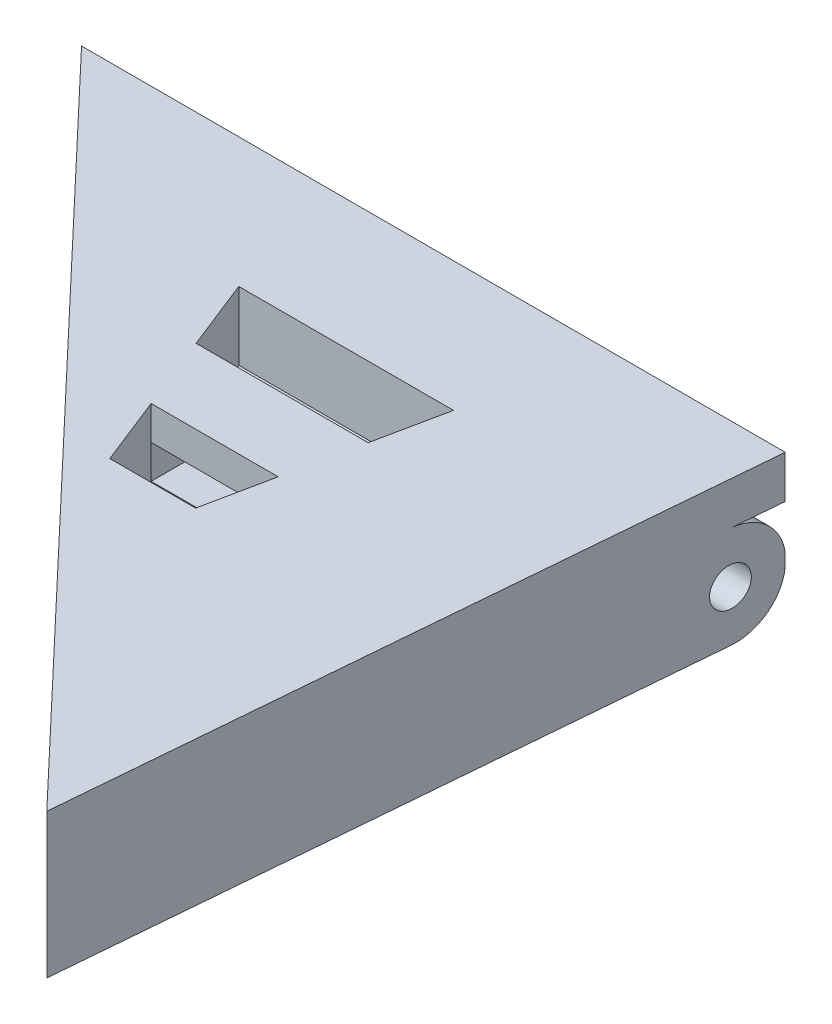
ISO-10303-21;
HEADER;
FILE_DESCRIPTION(('STEP AP214'),'2;1');
FILE_NAME('part.step','',(''),(''),'','','');
FILE_SCHEMA(('AUTOMOTIVE_DESIGN { 1 0 10303 214 1 1 1 1 }'));
ENDSEC;
DATA;
#1=APPLICATION_CONTEXT('core data for automotive mechanical design processes');
#2=APPLICATION_PROTOCOL_DEFINITION('international standard','automotive_design',2000,#1);
#3=PRODUCT_CONTEXT('',#1,'mechanical');
#4=PRODUCT('Part','Part','',(#3));
#5=PRODUCT_RELATED_PRODUCT_CATEGORY('part','',(#4));
#6=PRODUCT_DEFINITION_FORMATION('','',#4);
#7=PRODUCT_DEFINITION_CONTEXT('part definition',#1,'design');
#8=PRODUCT_DEFINITION('design','',#6,#7);
#9=PRODUCT_DEFINITION_SHAPE('','',#8);
#10=(LENGTH_UNIT() NAMED_UNIT(*) SI_UNIT(.MILLI.,.METRE.));
#11=(NAMED_UNIT(*) PLANE_ANGLE_UNIT() SI_UNIT($,.RADIAN.));
#12=(NAMED_UNIT(*) SI_UNIT($,.STERADIAN.) SOLID_ANGLE_UNIT());
#13=UNCERTAINTY_MEASURE_WITH_UNIT(LENGTH_MEASURE(1.E-05),#10,'distance_accuracy_value','');
#14=(GEOMETRIC_REPRESENTATION_CONTEXT(3) GLOBAL_UNCERTAINTY_ASSIGNED_CONTEXT((#13)) GLOBAL_UNIT_ASSIGNED_CONTEXT((#10,
#11,#12)) REPRESENTATION_CONTEXT('',''));
#15=CARTESIAN_POINT('',(0.,0.,0.));
#16=DIRECTION('',(0.,0.,1.));
#17=DIRECTION('',(1.,0.,0.));
#18=AXIS2_PLACEMENT_3D('',#15,#16,#17);
#19=CARTESIAN_POINT('',(0.,15.24,0.));
#20=DIRECTION('',(0.,0.,1.));
#21=DIRECTION('',(1.,0.,0.));
#22=AXIS2_PLACEMENT_3D('',#19,#20,#21);
#23=PLANE('',#22);
#24=DIRECTION('',(1.,0.,0.));
#25=VECTOR('',#24,1.);
#26=CARTESIAN_POINT('',(-7.2094547130586,12.7,0.));
#27=LINE('',#26,#25);
#28=CARTESIAN_POINT('',(0.,12.7,0.));
#29=VERTEX_POINT('',#28);
#30=CARTESIAN_POINT('',(21.1386477693797,12.7,0.));
#31=VERTEX_POINT('',#30);
#32=EDGE_CURVE('E275',#29,#31,#27,.T.);
#33=ORIENTED_EDGE('',*,*,#32,.T.);
#34=DIRECTION('',(0.,-1.,0.));
#35=VECTOR('',#34,1.);
#36=CARTESIAN_POINT('',(21.1386477693797,15.24,0.));
#37=LINE('',#36,#35);
#38=CARTESIAN_POINT('',(21.1386477693797,6.64498479126935,0.));
#39=VERTEX_POINT('',#38);
#40=EDGE_CURVE('E437',#31,#39,#37,.T.);
#41=ORIENTED_EDGE('',*,*,#40,.T.);
#42=DIRECTION('',(1.,0.,0.));
#43=VECTOR('',#42,1.);
#44=CARTESIAN_POINT('',(0.,6.64498479126935,0.));
#45=LINE('',#44,#43);
#46=CARTESIAN_POINT('',(0.,6.64498479126935,0.));
#47=VERTEX_POINT('',#46);
#48=EDGE_CURVE('E457',#47,#39,#45,.T.);
#49=ORIENTED_EDGE('',*,*,#48,.F.);
#50=DIRECTION('',(0.,-1.,0.));
#51=VECTOR('',#50,1.);
#52=CARTESIAN_POINT('',(0.,15.24,0.));
#53=LINE('',#52,#51);
#54=EDGE_CURVE('E434',#29,#47,#53,.T.);
#55=ORIENTED_EDGE('',*,*,#54,.F.);
#56=EDGE_LOOP('',(#33,#41,#49,#55));
#57=FACE_BOUND('',#56,.T.);
#58=ADVANCED_FACE('F94',(#57),#23,.F.);
#59=CARTESIAN_POINT('',(0.,11.176,10.3526951247771));
#60=DIRECTION('',(0.,0.,-1.));
#61=DIRECTION('',(-1.,0.,0.));
#62=AXIS2_PLACEMENT_3D('',#59,#60,#61);
#63=PLANE('',#62);
#64=DIRECTION('',(0.,1.,0.));
#65=VECTOR('',#64,1.);
#66=CARTESIAN_POINT('',(15.1568269692433,11.176,10.3526951247771));
#67=LINE('',#66,#65);
#68=CARTESIAN_POINT('',(15.1568269692433,11.176,10.3526951247771));
#69=VERTEX_POINT('',#68);
#70=CARTESIAN_POINT('',(15.1568269692433,11.2250711949438,10.3526951247771));
#71=VERTEX_POINT('',#70);
#72=EDGE_CURVE('E373',#69,#71,#67,.T.);
#73=ORIENTED_EDGE('',*,*,#72,.T.);
#74=DIRECTION('',(1.,0.,0.));
#75=VECTOR('',#74,1.);
#76=CARTESIAN_POINT('',(0.,11.2250711949438,10.3526951247771));
#77=LINE('',#76,#75);
#78=CARTESIAN_POINT('',(7.59330369392899,11.2250711949438,10.3526951247771));
#79=VERTEX_POINT('',#78);
#80=EDGE_CURVE('E109',#79,#71,#77,.T.);
#81=ORIENTED_EDGE('',*,*,#80,.F.);
#82=DIRECTION('',(0.,1.,0.));
#83=VECTOR('',#82,1.);
#84=CARTESIAN_POINT('',(7.59330369392899,11.176,10.3526951247771));
#85=LINE('',#84,#83);
#86=CARTESIAN_POINT('',(7.59330369392899,11.176,10.3526951247771));
#87=VERTEX_POINT('',#86);
#88=EDGE_CURVE('E369',#87,#79,#85,.T.);
#89=ORIENTED_EDGE('',*,*,#88,.F.);
#90=DIRECTION('',(-1.,0.,0.));
#91=VECTOR('',#90,1.);
#92=CARTESIAN_POINT('',(0.,11.176,10.3526951247771));
#93=LINE('',#92,#91);
#94=EDGE_CURVE('E351',#69,#87,#93,.T.);
#95=ORIENTED_EDGE('',*,*,#94,.F.);
#96=EDGE_LOOP('',(#73,#81,#89,#95));
#97=FACE_BOUND('',#96,.T.);
#98=ADVANCED_FACE('F503',(#97),#63,.F.);
#99=CARTESIAN_POINT('',(0.,15.24,0.));
#100=DIRECTION('',(0.,1.,0.));
#101=DIRECTION('',(0.,0.,1.));
#102=AXIS2_PLACEMENT_3D('',#99,#100,#101);
#103=PLANE('',#102);
#104=DIRECTION('',(0.0854169231373713,0.,-0.996345296190906));
#105=VECTOR('',#104,1.);
#106=CARTESIAN_POINT('',(28.985570047407,15.24,-6.0052976617556));
#107=LINE('',#106,#105);
#108=CARTESIAN_POINT('',(25.5142262911042,15.24,34.4861751754428));
#109=VERTEX_POINT('',#108);
#110=CARTESIAN_POINT('',(28.985570047407,15.24,-6.0052976617556));
#111=VERTEX_POINT('',#110);
#112=EDGE_CURVE('E432',#109,#111,#107,.T.);
#113=ORIENTED_EDGE('',*,*,#112,.T.);
#114=DIRECTION('',(-1.,0.,0.));
#115=VECTOR('',#114,1.);
#116=CARTESIAN_POINT('',(28.985570047407,15.24,-6.0052976617556));
#117=LINE('',#116,#115);
#118=CARTESIAN_POINT('',(-12.9078380222715,15.24,-6.0052976617556));
#119=VERTEX_POINT('',#118);
#120=EDGE_CURVE('E283',#111,#119,#117,.T.);
#121=ORIENTED_EDGE('',*,*,#120,.T.);
#122=DIRECTION('',(0.688327157436138,0.,0.725400388982448));
#123=VECTOR('',#122,1.);
#124=CARTESIAN_POINT('',(-12.9078380222715,15.24,-6.0052976617556));
#125=LINE('',#124,#123);
#126=EDGE_CURVE('E428',#119,#109,#125,.T.);
#127=ORIENTED_EDGE('',*,*,#126,.T.);
#128=EDGE_LOOP('',(#113,#121,#127));
#129=FACE_BOUND('',#128,.T.);
#130=DIRECTION('',(-0.203030500491171,0.,0.979172413760878));
#131=VECTOR('',#130,1.);
#132=CARTESIAN_POINT('',(16.5901766835513,15.24,3.43995789501577));
#133=LINE('',#132,#131);
#134=CARTESIAN_POINT('',(15.1568269692433,15.24,10.3526951247771));
#135=VERTEX_POINT('',#134);
#136=CARTESIAN_POINT('',(14.3126497278338,15.24,14.4239803017001));
#137=VERTEX_POINT('',#136);
#138=EDGE_CURVE('E360',#135,#137,#133,.T.);
#139=ORIENTED_EDGE('',*,*,#138,.T.);
#140=DIRECTION('',(-1.,0.,0.));
#141=VECTOR('',#140,1.);
#142=CARTESIAN_POINT('',(0.,15.24,14.4239803017001));
#143=LINE('',#142,#141);
#144=CARTESIAN_POINT('',(9.20685766168644,15.24,14.4239803017001));
#145=VERTEX_POINT('',#144);
#146=EDGE_CURVE('E308',#137,#145,#143,.T.);
#147=ORIENTED_EDGE('',*,*,#146,.T.);
#148=DIRECTION('',(0.3684439491509,0.,0.929649964413536));
#149=VECTOR('',#148,1.);
#150=CARTESIAN_POINT('',(3.01645999863433,15.24,-1.19549989447229));
#151=LINE('',#150,#149);
#152=CARTESIAN_POINT('',(7.59330369392899,15.24,10.3526951247771));
#153=VERTEX_POINT('',#152);
#154=EDGE_CURVE('E349',#153,#145,#151,.T.);
#155=ORIENTED_EDGE('',*,*,#154,.F.);
#156=DIRECTION('',(-1.,0.,0.));
#157=VECTOR('',#156,1.);
#158=CARTESIAN_POINT('',(0.,15.24,10.3526951247771));
#159=LINE('',#158,#157);
#160=EDGE_CURVE('E363',#135,#153,#159,.T.);
#161=ORIENTED_EDGE('',*,*,#160,.F.);
#162=EDGE_LOOP('',(#139,#147,#155,#161));
#163=FACE_BOUND('',#162,.T.);
#164=DIRECTION('',(-0.203030500491171,0.,0.979172413760878));
#165=VECTOR('',#164,1.);
#166=CARTESIAN_POINT('',(16.5901766835513,15.24,3.43995789501577));
#167=LINE('',#166,#165);
#168=CARTESIAN_POINT('',(16.9489737358445,15.24,1.70955692129837));
#169=VERTEX_POINT('',#168);
#170=CARTESIAN_POINT('',(16.0771185520925,15.24,5.91432685812613));
#171=VERTEX_POINT('',#170);
#172=EDGE_CURVE('E328',#169,#171,#167,.T.);
#173=ORIENTED_EDGE('',*,*,#172,.T.);
#174=DIRECTION('',(-1.,0.,0.));
#175=VECTOR('',#174,1.);
#176=CARTESIAN_POINT('',(0.,15.24,5.91432685812613));
#177=LINE('',#176,#175);
#178=CARTESIAN_POINT('',(5.83426535202734,15.24,5.91432685812613));
#179=VERTEX_POINT('',#178);
#180=EDGE_CURVE('E325',#171,#179,#177,.T.);
#181=ORIENTED_EDGE('',*,*,#180,.T.);
#182=DIRECTION('',(0.3684439491509,0.,0.929649964413536));
#183=VECTOR('',#182,1.);
#184=CARTESIAN_POINT('',(3.01645999863433,15.24,-1.19549989447229));
#185=LINE('',#184,#183);
#186=CARTESIAN_POINT('',(4.16780797548872,15.24,1.70955692129837));
#187=VERTEX_POINT('',#186);
#188=EDGE_CURVE('E316',#187,#179,#185,.T.);
#189=ORIENTED_EDGE('',*,*,#188,.F.);
#190=DIRECTION('',(-1.,0.,0.));
#191=VECTOR('',#190,1.);
#192=CARTESIAN_POINT('',(0.,15.24,1.70955692129837));
#193=LINE('',#192,#191);
#194=EDGE_CURVE('E332',#169,#187,#193,.T.);
#195=ORIENTED_EDGE('',*,*,#194,.F.);
#196=EDGE_LOOP('',(#173,#181,#189,#195));
#197=FACE_BOUND('',#196,.T.);
#198=ADVANCED_FACE('F495',(#129,#163,#197),#103,.T.);
#199=CARTESIAN_POINT('',(21.1386477693797,15.24,-6.0052976617556));
#200=DIRECTION('',(0.,0.,1.));
#201=DIRECTION('',(1.,0.,0.));
#202=AXIS2_PLACEMENT_3D('',#199,#200,#201);
#203=PLANE('',#202);
#204=DIRECTION('',(1.,0.,0.));
#205=VECTOR('',#204,1.);
#206=CARTESIAN_POINT('',(-19.812,9.28532022086222,-6.0052976617556));
#207=LINE('',#206,#205);
#208=CARTESIAN_POINT('',(21.1386477693797,9.28532022086222,-6.0052976617556));
#209=VERTEX_POINT('',#208);
#210=CARTESIAN_POINT('',(28.985570047407,9.28532022086222,-6.0052976617556));
#211=VERTEX_POINT('',#210);
#212=EDGE_CURVE('E379',#209,#211,#207,.T.);
#213=ORIENTED_EDGE('',*,*,#212,.F.);
#214=DIRECTION('',(0.,-1.,0.));
#215=VECTOR('',#214,1.);
#216=CARTESIAN_POINT('',(21.1386477693797,15.24,-6.0052976617556));
#217=LINE('',#216,#215);
#218=CARTESIAN_POINT('',(21.1386477693797,10.0596645704071,-6.0052976617556));
#219=VERTEX_POINT('',#218);
#220=EDGE_CURVE('E440',#219,#209,#217,.T.);
#221=ORIENTED_EDGE('',*,*,#220,.F.);
#222=DIRECTION('',(-1.,0.,0.));
#223=VECTOR('',#222,1.);
#224=CARTESIAN_POINT('',(34.544,10.0596645704071,-6.0052976617556));
#225=LINE('',#224,#223);
#226=CARTESIAN_POINT('',(28.985570047407,10.0596645704071,-6.0052976617556));
#227=VERTEX_POINT('',#226);
#228=EDGE_CURVE('E389',#227,#219,#225,.T.);
#229=ORIENTED_EDGE('',*,*,#228,.F.);
#230=DIRECTION('',(0.,-1.,0.));
#231=VECTOR('',#230,1.);
#232=CARTESIAN_POINT('',(28.985570047407,15.24,-6.0052976617556));
#233=LINE('',#232,#231);
#234=EDGE_CURVE('E443',#227,#211,#233,.T.);
#235=ORIENTED_EDGE('',*,*,#234,.T.);
#236=EDGE_LOOP('',(#213,#221,#229,#235));
#237=FACE_BOUND('',#236,.T.);
#238=ADVANCED_FACE('F535',(#237),#203,.F.);
#239=CARTESIAN_POINT('',(21.1386477693797,15.24,0.));
#240=DIRECTION('',(1.,0.,0.));
#241=DIRECTION('',(0.,0.,-1.));
#242=AXIS2_PLACEMENT_3D('',#239,#240,#241);
#243=PLANE('',#242);
#244=CARTESIAN_POINT('',(21.1386477693797,9.67249239563468,-3.0026488308778));
#245=DIRECTION('',(1.,0.,0.));
#246=DIRECTION('',(0.,0.,-1.));
#247=AXIS2_PLACEMENT_3D('',#244,#245,#246);
#248=CIRCLE('',#247,1.1450691153312);
#249=CARTESIAN_POINT('',(21.1386477693797,9.67249239563468,-4.147717946209));
#250=VERTEX_POINT('',#249);
#251=EDGE_CURVE('E415',#250,#250,#248,.F.);
#252=ORIENTED_EDGE('',*,*,#251,.F.);
#253=EDGE_LOOP('',(#252));
#254=FACE_BOUND('',#253,.T.);
#255=CARTESIAN_POINT('',(21.1386477693797,9.67249239563468,-3.0026488308778));
#256=DIRECTION('',(1.,0.,0.));
#257=DIRECTION('',(0.,0.,-1.));
#258=AXIS2_PLACEMENT_3D('',#255,#256,#257);
#259=CIRCLE('',#258,3.02750760436532);
#260=CARTESIAN_POINT('',(21.1386477693797,6.64498479126935,-3.0026488308778));
#261=VERTEX_POINT('',#260);
#262=EDGE_CURVE('E422',#261,#209,#259,.T.);
#263=ORIENTED_EDGE('',*,*,#262,.F.);
#264=DIRECTION('',(0.,0.,-1.));
#265=VECTOR('',#264,1.);
#266=CARTESIAN_POINT('',(21.1386477693797,6.64498479126935,0.));
#267=LINE('',#266,#265);
#268=EDGE_CURVE('E402',#39,#261,#267,.T.);
#269=ORIENTED_EDGE('',*,*,#268,.F.);
#270=ORIENTED_EDGE('',*,*,#40,.F.);
#271=DIRECTION('',(0.,0.,1.));
#272=VECTOR('',#271,1.);
#273=CARTESIAN_POINT('',(21.1386477693797,12.7,-6.0052976617556));
#274=LINE('',#273,#272);
#275=CARTESIAN_POINT('',(21.1386477693797,12.7,-3.0026488308778));
#276=VERTEX_POINT('',#275);
#277=EDGE_CURVE('E425',#276,#31,#274,.T.);
#278=ORIENTED_EDGE('',*,*,#277,.F.);
#279=CARTESIAN_POINT('',(21.1386477693797,9.67249239563468,-3.0026488308778));
#280=DIRECTION('',(1.,0.,0.));
#281=DIRECTION('',(0.,0.,-1.));
#282=AXIS2_PLACEMENT_3D('',#279,#280,#281);
#283=CIRCLE('',#282,3.02750760436532);
#284=EDGE_CURVE('E397',#276,#219,#283,.F.);
#285=ORIENTED_EDGE('',*,*,#284,.T.);
#286=ORIENTED_EDGE('',*,*,#220,.T.);
#287=EDGE_LOOP('',(#263,#269,#270,#278,#285,#286));
#288=FACE_BOUND('',#287,.T.);
#289=ADVANCED_FACE('F532',(#254,#288),#243,.F.);
#290=CARTESIAN_POINT('',(0.,15.24,0.));
#291=DIRECTION('',(-1.,0.,0.));
#292=DIRECTION('',(0.,0.,1.));
#293=AXIS2_PLACEMENT_3D('',#290,#291,#292);
#294=PLANE('',#293);
#295=CARTESIAN_POINT('',(0.,9.67249239563468,-3.0026488308778));
#296=DIRECTION('',(-1.,0.,0.));
#297=DIRECTION('',(0.,0.,1.));
#298=AXIS2_PLACEMENT_3D('',#295,#296,#297);
#299=CIRCLE('',#298,1.1450691153312);
#300=CARTESIAN_POINT('',(0.,9.67249239563468,-1.8575797155466));
#301=VERTEX_POINT('',#300);
#302=EDGE_CURVE('E412',#301,#301,#299,.F.);
#303=ORIENTED_EDGE('',*,*,#302,.F.);
#304=EDGE_LOOP('',(#303));
#305=FACE_BOUND('',#304,.T.);
#306=CARTESIAN_POINT('',(0.,9.67249239563468,-3.0026488308778));
#307=DIRECTION('',(-1.,0.,0.));
#308=DIRECTION('',(0.,0.,1.));
#309=AXIS2_PLACEMENT_3D('',#306,#307,#308);
#310=CIRCLE('',#309,3.02750760436532);
#311=CARTESIAN_POINT('',(0.,9.28532022086222,-6.0052976617556));
#312=VERTEX_POINT('',#311);
#313=CARTESIAN_POINT('',(0.,6.64498479126935,-3.0026488308778));
#314=VERTEX_POINT('',#313);
#315=EDGE_CURVE('E420',#312,#314,#310,.T.);
#316=ORIENTED_EDGE('',*,*,#315,.F.);
#317=DIRECTION('',(0.,-1.,0.));
#318=VECTOR('',#317,1.);
#319=CARTESIAN_POINT('',(0.,15.24,-6.0052976617556));
#320=LINE('',#319,#318);
#321=CARTESIAN_POINT('',(0.,10.0596645704071,-6.0052976617556));
#322=VERTEX_POINT('',#321);
#323=EDGE_CURVE('E452',#322,#312,#320,.T.);
#324=ORIENTED_EDGE('',*,*,#323,.F.);
#325=CARTESIAN_POINT('',(0.,9.67249239563468,-3.0026488308778));
#326=DIRECTION('',(-1.,0.,0.));
#327=DIRECTION('',(0.,0.,1.));
#328=AXIS2_PLACEMENT_3D('',#325,#326,#327);
#329=CIRCLE('',#328,3.02750760436532);
#330=CARTESIAN_POINT('',(0.,12.7,-3.0026488308778));
#331=VERTEX_POINT('',#330);
#332=EDGE_CURVE('E394',#322,#331,#329,.F.);
#333=ORIENTED_EDGE('',*,*,#332,.T.);
#334=DIRECTION('',(0.,0.,-1.));
#335=VECTOR('',#334,1.);
#336=CARTESIAN_POINT('',(0.,12.7,-6.0052976617556));
#337=LINE('',#336,#335);
#338=EDGE_CURVE('E424',#29,#331,#337,.T.);
#339=ORIENTED_EDGE('',*,*,#338,.F.);
#340=ORIENTED_EDGE('',*,*,#54,.T.);
#341=DIRECTION('',(0.,0.,1.));
#342=VECTOR('',#341,1.);
#343=CARTESIAN_POINT('',(0.,6.64498479126935,0.));
#344=LINE('',#343,#342);
#345=EDGE_CURVE('E400',#314,#47,#344,.T.);
#346=ORIENTED_EDGE('',*,*,#345,.F.);
#347=EDGE_LOOP('',(#316,#324,#333,#339,#340,#346));
#348=FACE_BOUND('',#347,.T.);
#349=ADVANCED_FACE('F96',(#305,#348),#294,.F.);
#350=CARTESIAN_POINT('',(0.,15.24,-6.0052976617556));
#351=DIRECTION('',(0.,0.,1.));
#352=DIRECTION('',(1.,0.,0.));
#353=AXIS2_PLACEMENT_3D('',#350,#351,#352);
#354=PLANE('',#353);
#355=CARTESIAN_POINT('',(-12.9078380222715,9.28532022086222,-6.0052976617556));
#356=VERTEX_POINT('',#355);
#357=EDGE_CURVE('E381',#356,#312,#207,.T.);
#358=ORIENTED_EDGE('',*,*,#357,.F.);
#359=DIRECTION('',(0.,-1.,0.));
#360=VECTOR('',#359,1.);
#361=CARTESIAN_POINT('',(-12.9078380222715,15.24,-6.0052976617556));
#362=LINE('',#361,#360);
#363=CARTESIAN_POINT('',(-12.9078380222715,10.0596645704071,-6.0052976617556));
#364=VERTEX_POINT('',#363);
#365=EDGE_CURVE('E449',#364,#356,#362,.T.);
#366=ORIENTED_EDGE('',*,*,#365,.F.);
#367=EDGE_CURVE('E387',#322,#364,#225,.T.);
#368=ORIENTED_EDGE('',*,*,#367,.F.);
#369=ORIENTED_EDGE('',*,*,#323,.T.);
#370=EDGE_LOOP('',(#358,#366,#368,#369));
#371=FACE_BOUND('',#370,.T.);
#372=ADVANCED_FACE('F545',(#371),#354,.F.);
#373=CARTESIAN_POINT('',(-12.9078380222715,15.24,-6.0052976617556));
#374=DIRECTION('',(0.725400388982448,0.,-0.688327157436138));
#375=DIRECTION('',(-0.688327157436138,0.,-0.725400388982448));
#376=AXIS2_PLACEMENT_3D('',#373,#374,#375);
#377=PLANE('',#376);
#378=ORIENTED_EDGE('',*,*,#126,.F.);
#379=DIRECTION('',(0.,1.,0.));
#380=VECTOR('',#379,1.);
#381=CARTESIAN_POINT('',(-12.9078380222715,12.7,-6.0052976617556));
#382=LINE('',#381,#380);
#383=CARTESIAN_POINT('',(-12.9078380222715,12.7,-6.0052976617556));
#384=VERTEX_POINT('',#383);
#385=EDGE_CURVE('E284',#384,#119,#382,.T.);
#386=ORIENTED_EDGE('',*,*,#385,.F.);
#387=DIRECTION('',(0.688327157436138,0.,0.725400388982448));
#388=VECTOR('',#387,1.);
#389=CARTESIAN_POINT('',(-12.9078380222715,12.7,-6.0052976617556));
#390=LINE('',#389,#388);
#391=CARTESIAN_POINT('',(-10.058646367665,12.7,-3.0026488308778));
#392=VERTEX_POINT('',#391);
#393=EDGE_CURVE('E285',#384,#392,#390,.T.);
#394=ORIENTED_EDGE('',*,*,#393,.T.);
#395=CARTESIAN_POINT('',(-10.058646367665,9.67249239563468,-3.0026488308778));
#396=DIRECTION('',(0.725400388982448,0.,-0.688327157436138));
#397=DIRECTION('',(-0.688327157436138,0.,-0.725400388982448));
#398=AXIS2_PLACEMENT_3D('',#395,#396,#397);
#399=ELLIPSE('',#398,4.17356766049181,3.02750760436532);
#400=EDGE_CURVE('E391',#392,#364,#399,.F.);
#401=ORIENTED_EDGE('',*,*,#400,.T.);
#402=ORIENTED_EDGE('',*,*,#365,.T.);
#403=CARTESIAN_POINT('',(-10.058646367665,9.67249239563468,-3.0026488308778));
#404=DIRECTION('',(0.725400388982448,0.,-0.688327157436138));
#405=DIRECTION('',(0.688327157436138,0.,0.725400388982448));
#406=AXIS2_PLACEMENT_3D('',#403,#404,#405);
#407=ELLIPSE('',#406,4.17356766049181,3.02750760436532);
#408=CARTESIAN_POINT('',(-10.058646367665,6.64498479126935,-3.0026488308778));
#409=VERTEX_POINT('',#408);
#410=EDGE_CURVE('E418',#409,#356,#407,.T.);
#411=ORIENTED_EDGE('',*,*,#410,.F.);
#412=DIRECTION('',(-0.688327157436138,0.,-0.725400388982448));
#413=VECTOR('',#412,1.);
#414=CARTESIAN_POINT('',(-12.9078380222715,6.64498479126935,-6.0052976617556));
#415=LINE('',#414,#413);
#416=CARTESIAN_POINT('',(25.5142262911042,6.64498479126935,34.4861751754428));
#417=VERTEX_POINT('',#416);
#418=EDGE_CURVE('E406',#417,#409,#415,.T.);
#419=ORIENTED_EDGE('',*,*,#418,.F.);
#420=DIRECTION('',(0.,-1.,0.));
#421=VECTOR('',#420,1.);
#422=CARTESIAN_POINT('',(25.5142262911042,15.24,34.4861751754428));
#423=LINE('',#422,#421);
#424=EDGE_CURVE('E446',#109,#417,#423,.T.);
#425=ORIENTED_EDGE('',*,*,#424,.F.);
#426=EDGE_LOOP('',(#378,#386,#394,#401,#402,#411,#419,#425));
#427=FACE_BOUND('',#426,.T.);
#428=CARTESIAN_POINT('',(-10.058646367665,9.67249239563468,-3.0026488308778));
#429=DIRECTION('',(0.725400388982448,0.,-0.688327157436138));
#430=DIRECTION('',(-0.688327157436138,0.,-0.725400388982448));
#431=AXIS2_PLACEMENT_3D('',#428,#429,#430);
#432=ELLIPSE('',#431,1.57853391412905,1.1450691153312);
#433=CARTESIAN_POINT('',(-11.145194129694,9.67249239563468,-4.147717946209));
#434=VERTEX_POINT('',#433);
#435=EDGE_CURVE('E409',#434,#434,#432,.F.);
#436=ORIENTED_EDGE('',*,*,#435,.F.);
#437=EDGE_LOOP('',(#436));
#438=FACE_BOUND('',#437,.T.);
#439=ADVANCED_FACE('F543',(#427,#438),#377,.F.);
#440=CARTESIAN_POINT('',(28.985570047407,15.24,-6.0052976617556));
#441=DIRECTION('',(-0.996345296190906,0.,-0.0854169231373713));
#442=DIRECTION('',(-0.0854169231373713,0.,0.996345296190906));
#443=AXIS2_PLACEMENT_3D('',#440,#441,#442);
#444=PLANE('',#443);
#445=DIRECTION('',(0.,1.,0.));
#446=VECTOR('',#445,1.);
#447=CARTESIAN_POINT('',(28.985570047407,12.7,-6.0052976617556));
#448=LINE('',#447,#446);
#449=CARTESIAN_POINT('',(28.985570047407,12.7,-6.0052976617556));
#450=VERTEX_POINT('',#449);
#451=EDGE_CURVE('E267',#450,#111,#448,.T.);
#452=ORIENTED_EDGE('',*,*,#451,.T.);
#453=ORIENTED_EDGE('',*,*,#112,.F.);
#454=ORIENTED_EDGE('',*,*,#424,.T.);
#455=DIRECTION('',(-0.0854169231373713,0.,0.996345296190906));
#456=VECTOR('',#455,1.);
#457=CARTESIAN_POINT('',(28.985570047407,6.64498479126935,-6.0052976617556));
#458=LINE('',#457,#456);
#459=CARTESIAN_POINT('',(28.7281522371598,6.64498479126935,-3.0026488308778));
#460=VERTEX_POINT('',#459);
#461=EDGE_CURVE('E404',#460,#417,#458,.T.);
#462=ORIENTED_EDGE('',*,*,#461,.F.);
#463=CARTESIAN_POINT('',(28.7281522371598,9.67249239563468,-3.0026488308778));
#464=DIRECTION('',(-0.996345296190906,0.,-0.0854169231373713));
#465=DIRECTION('',(0.0854169231373713,0.,-0.996345296190906));
#466=AXIS2_PLACEMENT_3D('',#463,#464,#465);
#467=ELLIPSE('',#466,3.03861283426507,3.02750760436532);
#468=EDGE_CURVE('E459',#211,#460,#467,.T.);
#469=ORIENTED_EDGE('',*,*,#468,.F.);
#470=ORIENTED_EDGE('',*,*,#234,.F.);
#471=CARTESIAN_POINT('',(28.7281522371598,9.67249239563468,-3.0026488308778));
#472=DIRECTION('',(-0.996345296190906,0.,-0.0854169231373713));
#473=DIRECTION('',(-0.0854169231373713,0.,0.996345296190906));
#474=AXIS2_PLACEMENT_3D('',#471,#472,#473);
#475=ELLIPSE('',#474,3.03861283426507,3.02750760436532);
#476=CARTESIAN_POINT('',(28.7281522371598,12.7,-3.0026488308778));
#477=VERTEX_POINT('',#476);
#478=EDGE_CURVE('E270',#227,#477,#475,.F.);
#479=ORIENTED_EDGE('',*,*,#478,.T.);
#480=DIRECTION('',(0.0854169231373716,0.,-0.996345296190906));
#481=VECTOR('',#480,1.);
#482=CARTESIAN_POINT('',(28.4707344269125,12.7,0.));
#483=LINE('',#482,#481);
#484=EDGE_CURVE('E262',#477,#450,#483,.T.);
#485=ORIENTED_EDGE('',*,*,#484,.T.);
#486=EDGE_LOOP('',(#452,#453,#454,#462,#469,#470,#479,#485));
#487=FACE_BOUND('',#486,.T.);
#488=CARTESIAN_POINT('',(28.7281522371598,9.67249239563468,-3.0026488308778));
#489=DIRECTION('',(-0.996345296190906,0.,-0.0854169231373713));
#490=DIRECTION('',(-0.0854169231373713,0.,0.996345296190906));
#491=AXIS2_PLACEMENT_3D('',#488,#489,#490);
#492=ELLIPSE('',#491,1.14926935441847,1.1450691153312);
#493=CARTESIAN_POINT('',(28.6299851850493,9.67249239563468,-1.8575797155466));
#494=VERTEX_POINT('',#493);
#495=EDGE_CURVE('E408',#494,#494,#492,.F.);
#496=ORIENTED_EDGE('',*,*,#495,.F.);
#497=EDGE_LOOP('',(#496));
#498=FACE_BOUND('',#497,.T.);
#499=ADVANCED_FACE('F264',(#487,#498),#444,.F.);
#500=CARTESIAN_POINT('',(34.544,9.67249239563468,-3.0026488308778));
#501=DIRECTION('',(-1.,0.,0.));
#502=DIRECTION('',(0.,0.,1.));
#503=AXIS2_PLACEMENT_3D('',#500,#501,#502);
#504=CYLINDRICAL_SURFACE('',#503,3.02750760436532);
#505=DIRECTION('',(-1.,0.,0.));
#506=VECTOR('',#505,1.);
#507=CARTESIAN_POINT('',(34.544,12.7,-3.0026488308778));
#508=LINE('',#507,#506);
#509=EDGE_CURVE('E455',#276,#477,#508,.F.);
#510=ORIENTED_EDGE('',*,*,#509,.T.);
#511=ORIENTED_EDGE('',*,*,#478,.F.);
#512=ORIENTED_EDGE('',*,*,#228,.T.);
#513=ORIENTED_EDGE('',*,*,#284,.F.);
#514=EDGE_LOOP('',(#510,#511,#512,#513));
#515=FACE_BOUND('',#514,.T.);
#516=ADVANCED_FACE('F542',(#515),#504,.T.);
#517=ORIENTED_EDGE('',*,*,#367,.T.);
#518=ORIENTED_EDGE('',*,*,#400,.F.);
#519=DIRECTION('',(-1.,0.,0.));
#520=VECTOR('',#519,1.);
#521=CARTESIAN_POINT('',(34.544,12.7,-3.0026488308778));
#522=LINE('',#521,#520);
#523=EDGE_CURVE('E385',#331,#392,#522,.T.);
#524=ORIENTED_EDGE('',*,*,#523,.F.);
#525=ORIENTED_EDGE('',*,*,#332,.F.);
#526=EDGE_LOOP('',(#517,#518,#524,#525));
#527=FACE_BOUND('',#526,.T.);
#528=ADVANCED_FACE('F563',(#527),#504,.T.);
#529=CARTESIAN_POINT('',(-19.812,9.67249239563468,-3.0026488308778));
#530=DIRECTION('',(1.,0.,0.));
#531=DIRECTION('',(0.,0.,-1.));
#532=AXIS2_PLACEMENT_3D('',#529,#530,#531);
#533=CYLINDRICAL_SURFACE('',#532,3.02750760436532);
#534=ORIENTED_EDGE('',*,*,#262,.T.);
#535=ORIENTED_EDGE('',*,*,#212,.T.);
#536=ORIENTED_EDGE('',*,*,#468,.T.);
#537=DIRECTION('',(1.,0.,0.));
#538=VECTOR('',#537,1.);
#539=CARTESIAN_POINT('',(-19.812,6.64498479126935,-3.0026488308778));
#540=LINE('',#539,#538);
#541=EDGE_CURVE('E339',#261,#460,#540,.T.);
#542=ORIENTED_EDGE('',*,*,#541,.F.);
#543=EDGE_LOOP('',(#534,#535,#536,#542));
#544=FACE_BOUND('',#543,.T.);
#545=ADVANCED_FACE('F581',(#544),#533,.T.);
#546=ORIENTED_EDGE('',*,*,#315,.T.);
#547=EDGE_CURVE('E382',#409,#314,#540,.T.);
#548=ORIENTED_EDGE('',*,*,#547,.F.);
#549=ORIENTED_EDGE('',*,*,#410,.T.);
#550=ORIENTED_EDGE('',*,*,#357,.T.);
#551=EDGE_LOOP('',(#546,#548,#549,#550));
#552=FACE_BOUND('',#551,.T.);
#553=ADVANCED_FACE('F835',(#552),#533,.T.);
#554=CARTESIAN_POINT('',(-19.812,6.64498479126935,0.));
#555=DIRECTION('',(0.,-1.,0.));
#556=DIRECTION('',(0.,0.,-1.));
#557=AXIS2_PLACEMENT_3D('',#554,#555,#556);
#558=PLANE('',#557);
#559=ORIENTED_EDGE('',*,*,#418,.T.);
#560=ORIENTED_EDGE('',*,*,#547,.T.);
#561=ORIENTED_EDGE('',*,*,#345,.T.);
#562=ORIENTED_EDGE('',*,*,#48,.T.);
#563=ORIENTED_EDGE('',*,*,#268,.T.);
#564=ORIENTED_EDGE('',*,*,#541,.T.);
#565=ORIENTED_EDGE('',*,*,#461,.T.);
#566=EDGE_LOOP('',(#559,#560,#561,#562,#563,#564,#565));
#567=FACE_BOUND('',#566,.T.);
#568=ADVANCED_FACE('F572',(#567),#558,.T.);
#569=CARTESIAN_POINT('',(34.544,9.67249239563468,-3.0026488308778));
#570=DIRECTION('',(-1.,0.,0.));
#571=DIRECTION('',(0.,0.,1.));
#572=AXIS2_PLACEMENT_3D('',#569,#570,#571);
#573=CYLINDRICAL_SURFACE('',#572,1.1450691153312);
#574=ORIENTED_EDGE('',*,*,#495,.T.);
#575=EDGE_LOOP('',(#574));
#576=FACE_BOUND('',#575,.T.);
#577=ORIENTED_EDGE('',*,*,#251,.T.);
#578=EDGE_LOOP('',(#577));
#579=FACE_BOUND('',#578,.T.);
#580=ADVANCED_FACE('F518',(#576,#579),#573,.F.);
#581=ORIENTED_EDGE('',*,*,#435,.T.);
#582=EDGE_LOOP('',(#581));
#583=FACE_BOUND('',#582,.T.);
#584=ORIENTED_EDGE('',*,*,#302,.T.);
#585=EDGE_LOOP('',(#584));
#586=FACE_BOUND('',#585,.T.);
#587=ADVANCED_FACE('F511',(#583,#586),#573,.F.);
#588=CARTESIAN_POINT('',(0.,11.176,14.4239803017001));
#589=DIRECTION('',(0.,0.,-1.));
#590=DIRECTION('',(-1.,0.,0.));
#591=AXIS2_PLACEMENT_3D('',#588,#589,#590);
#592=PLANE('',#591);
#593=ORIENTED_EDGE('',*,*,#146,.F.);
#594=DIRECTION('',(0.,1.,0.));
#595=VECTOR('',#594,1.);
#596=CARTESIAN_POINT('',(14.3126497278338,11.176,14.4239803017001));
#597=LINE('',#596,#595);
#598=CARTESIAN_POINT('',(14.3126497278338,11.176,14.4239803017001));
#599=VERTEX_POINT('',#598);
#600=EDGE_CURVE('E357',#599,#137,#597,.T.);
#601=ORIENTED_EDGE('',*,*,#600,.F.);
#602=DIRECTION('',(-1.,0.,0.));
#603=VECTOR('',#602,1.);
#604=CARTESIAN_POINT('',(0.,11.176,14.4239803017001));
#605=LINE('',#604,#603);
#606=CARTESIAN_POINT('',(9.20685766168644,11.176,14.4239803017001));
#607=VERTEX_POINT('',#606);
#608=EDGE_CURVE('E346',#599,#607,#605,.T.);
#609=ORIENTED_EDGE('',*,*,#608,.T.);
#610=DIRECTION('',(0.,1.,0.));
#611=VECTOR('',#610,1.);
#612=CARTESIAN_POINT('',(9.20685766168644,11.176,14.4239803017001));
#613=LINE('',#612,#611);
#614=EDGE_CURVE('E329',#607,#145,#613,.T.);
#615=ORIENTED_EDGE('',*,*,#614,.T.);
#616=EDGE_LOOP('',(#593,#601,#609,#615));
#617=FACE_BOUND('',#616,.T.);
#618=ADVANCED_FACE('F509',(#617),#592,.T.);
#619=CARTESIAN_POINT('',(3.01645999863433,11.176,-1.19549989447229));
#620=DIRECTION('',(-0.929649964413536,0.,0.3684439491509));
#621=DIRECTION('',(0.3684439491509,0.,0.929649964413536));
#622=AXIS2_PLACEMENT_3D('',#619,#620,#621);
#623=PLANE('',#622);
#624=ORIENTED_EDGE('',*,*,#154,.T.);
#625=ORIENTED_EDGE('',*,*,#614,.F.);
#626=DIRECTION('',(0.3684439491509,0.,0.929649964413536));
#627=VECTOR('',#626,1.);
#628=CARTESIAN_POINT('',(3.01645999863433,11.176,-1.19549989447229));
#629=LINE('',#628,#627);
#630=EDGE_CURVE('E354',#87,#607,#629,.T.);
#631=ORIENTED_EDGE('',*,*,#630,.F.);
#632=ORIENTED_EDGE('',*,*,#88,.T.);
#633=DIRECTION('',(0.,-1.,0.));
#634=VECTOR('',#633,1.);
#635=CARTESIAN_POINT('',(7.59330369392899,0.,10.3526951247771));
#636=LINE('',#635,#634);
#637=CARTESIAN_POINT('',(7.59330369392899,13.2325355974719,10.3526951247771));
#638=VERTEX_POINT('',#637);
#639=EDGE_CURVE('E301',#638,#79,#636,.T.);
#640=ORIENTED_EDGE('',*,*,#639,.F.);
#641=EDGE_CURVE('E372',#638,#153,#85,.T.);
#642=ORIENTED_EDGE('',*,*,#641,.T.);
#643=EDGE_LOOP('',(#624,#625,#631,#632,#640,#642));
#644=FACE_BOUND('',#643,.T.);
#645=ADVANCED_FACE('F499',(#644),#623,.F.);
#646=ORIENTED_EDGE('',*,*,#641,.F.);
#647=DIRECTION('',(-1.,0.,0.));
#648=VECTOR('',#647,1.);
#649=CARTESIAN_POINT('',(0.,13.2325355974719,10.3526951247771));
#650=LINE('',#649,#648);
#651=CARTESIAN_POINT('',(15.1568269692433,13.2325355974719,10.3526951247771));
#652=VERTEX_POINT('',#651);
#653=EDGE_CURVE('E299',#652,#638,#650,.T.);
#654=ORIENTED_EDGE('',*,*,#653,.F.);
#655=EDGE_CURVE('E376',#652,#135,#67,.T.);
#656=ORIENTED_EDGE('',*,*,#655,.T.);
#657=ORIENTED_EDGE('',*,*,#160,.T.);
#658=EDGE_LOOP('',(#646,#654,#656,#657));
#659=FACE_BOUND('',#658,.T.);
#660=ADVANCED_FACE('F488',(#659),#63,.F.);
#661=CARTESIAN_POINT('',(16.5901766835513,11.176,3.43995789501577));
#662=DIRECTION('',(-0.979172413760878,0.,-0.203030500491171));
#663=DIRECTION('',(-0.203030500491171,0.,0.979172413760878));
#664=AXIS2_PLACEMENT_3D('',#661,#662,#663);
#665=PLANE('',#664);
#666=ORIENTED_EDGE('',*,*,#138,.F.);
#667=ORIENTED_EDGE('',*,*,#655,.F.);
#668=DIRECTION('',(0.,1.,0.));
#669=VECTOR('',#668,1.);
#670=CARTESIAN_POINT('',(15.1568269692433,0.,10.3526951247771));
#671=LINE('',#670,#669);
#672=EDGE_CURVE('E295',#71,#652,#671,.T.);
#673=ORIENTED_EDGE('',*,*,#672,.F.);
#674=ORIENTED_EDGE('',*,*,#72,.F.);
#675=DIRECTION('',(-0.203030500491171,0.,0.979172413760878));
#676=VECTOR('',#675,1.);
#677=CARTESIAN_POINT('',(16.5901766835513,11.176,3.43995789501577));
#678=LINE('',#677,#676);
#679=EDGE_CURVE('E348',#69,#599,#678,.T.);
#680=ORIENTED_EDGE('',*,*,#679,.T.);
#681=ORIENTED_EDGE('',*,*,#600,.T.);
#682=EDGE_LOOP('',(#666,#667,#673,#674,#680,#681));
#683=FACE_BOUND('',#682,.T.);
#684=ADVANCED_FACE('F490',(#683),#665,.T.);
#685=CARTESIAN_POINT('',(0.,11.176,0.));
#686=DIRECTION('',(0.,1.,0.));
#687=DIRECTION('',(0.,0.,1.));
#688=AXIS2_PLACEMENT_3D('',#685,#686,#687);
#689=PLANE('',#688);
#690=ORIENTED_EDGE('',*,*,#608,.F.);
#691=ORIENTED_EDGE('',*,*,#679,.F.);
#692=ORIENTED_EDGE('',*,*,#94,.T.);
#693=ORIENTED_EDGE('',*,*,#630,.T.);
#694=EDGE_LOOP('',(#690,#691,#692,#693));
#695=FACE_BOUND('',#694,.T.);
#696=ADVANCED_FACE('F507',(#695),#689,.T.);
#697=CARTESIAN_POINT('',(0.,11.176,5.91432685812613));
#698=DIRECTION('',(0.,0.,-1.));
#699=DIRECTION('',(-1.,0.,0.));
#700=AXIS2_PLACEMENT_3D('',#697,#698,#699);
#701=PLANE('',#700);
#702=DIRECTION('',(0.,-1.,0.));
#703=VECTOR('',#702,1.);
#704=CARTESIAN_POINT('',(15.1568269692433,11.176,5.91432685812613));
#705=LINE('',#704,#703);
#706=CARTESIAN_POINT('',(15.1568269692433,13.2325355974719,5.91432685812613));
#707=VERTEX_POINT('',#706);
#708=CARTESIAN_POINT('',(15.1568269692433,11.2250711949438,5.91432685812613));
#709=VERTEX_POINT('',#708);
#710=EDGE_CURVE('E12',#707,#709,#705,.T.);
#711=ORIENTED_EDGE('',*,*,#710,.F.);
#712=DIRECTION('',(1.,0.,0.));
#713=VECTOR('',#712,1.);
#714=CARTESIAN_POINT('',(0.,13.2325355974719,5.91432685812613));
#715=LINE('',#714,#713);
#716=CARTESIAN_POINT('',(7.59330369392899,13.2325355974719,5.91432685812613));
#717=VERTEX_POINT('',#716);
#718=EDGE_CURVE('E463',#717,#707,#715,.T.);
#719=ORIENTED_EDGE('',*,*,#718,.F.);
#720=DIRECTION('',(0.,1.,0.));
#721=VECTOR('',#720,1.);
#722=CARTESIAN_POINT('',(7.59330369392899,11.176,5.91432685812613));
#723=LINE('',#722,#721);
#724=CARTESIAN_POINT('',(7.59330369392899,11.2250711949438,5.91432685812613));
#725=VERTEX_POINT('',#724);
#726=EDGE_CURVE('E465',#725,#717,#723,.T.);
#727=ORIENTED_EDGE('',*,*,#726,.F.);
#728=DIRECTION('',(-1.,0.,0.));
#729=VECTOR('',#728,1.);
#730=CARTESIAN_POINT('',(0.,11.2250711949438,5.91432685812613));
#731=LINE('',#730,#729);
#732=EDGE_CURVE('E102',#709,#725,#731,.T.);
#733=ORIENTED_EDGE('',*,*,#732,.F.);
#734=EDGE_LOOP('',(#711,#719,#727,#733));
#735=FACE_BOUND('',#734,.T.);
#736=ORIENTED_EDGE('',*,*,#180,.F.);
#737=DIRECTION('',(0.,1.,0.));
#738=VECTOR('',#737,1.);
#739=CARTESIAN_POINT('',(16.0771185520925,11.176,5.91432685812613));
#740=LINE('',#739,#738);
#741=CARTESIAN_POINT('',(16.0771185520925,11.176,5.91432685812613));
#742=VERTEX_POINT('',#741);
#743=EDGE_CURVE('E324',#742,#171,#740,.T.);
#744=ORIENTED_EDGE('',*,*,#743,.F.);
#745=DIRECTION('',(-1.,0.,0.));
#746=VECTOR('',#745,1.);
#747=CARTESIAN_POINT('',(0.,11.176,5.91432685812613));
#748=LINE('',#747,#746);
#749=CARTESIAN_POINT('',(5.83426535202734,11.176,5.91432685812613));
#750=VERTEX_POINT('',#749);
#751=EDGE_CURVE('E313',#742,#750,#748,.T.);
#752=ORIENTED_EDGE('',*,*,#751,.T.);
#753=DIRECTION('',(0.,1.,0.));
#754=VECTOR('',#753,1.);
#755=CARTESIAN_POINT('',(5.83426535202734,11.176,5.91432685812613));
#756=LINE('',#755,#754);
#757=EDGE_CURVE('E337',#750,#179,#756,.T.);
#758=ORIENTED_EDGE('',*,*,#757,.T.);
#759=EDGE_LOOP('',(#736,#744,#752,#758));
#760=FACE_BOUND('',#759,.T.);
#761=ADVANCED_FACE('F476',(#735,#760),#701,.T.);
#762=CARTESIAN_POINT('',(3.01645999863433,11.176,-1.19549989447229));
#763=DIRECTION('',(-0.929649964413536,0.,0.3684439491509));
#764=DIRECTION('',(0.3684439491509,0.,0.929649964413536));
#765=AXIS2_PLACEMENT_3D('',#762,#763,#764);
#766=PLANE('',#765);
#767=ORIENTED_EDGE('',*,*,#188,.T.);
#768=ORIENTED_EDGE('',*,*,#757,.F.);
#769=DIRECTION('',(0.3684439491509,0.,0.929649964413536));
#770=VECTOR('',#769,1.);
#771=CARTESIAN_POINT('',(3.01645999863433,11.176,-1.19549989447229));
#772=LINE('',#771,#770);
#773=CARTESIAN_POINT('',(4.16780797548872,11.176,1.70955692129837));
#774=VERTEX_POINT('',#773);
#775=EDGE_CURVE('E321',#774,#750,#772,.T.);
#776=ORIENTED_EDGE('',*,*,#775,.F.);
#777=DIRECTION('',(0.,1.,0.));
#778=VECTOR('',#777,1.);
#779=CARTESIAN_POINT('',(4.16780797548872,11.176,1.70955692129837));
#780=LINE('',#779,#778);
#781=EDGE_CURVE('E340',#774,#187,#780,.T.);
#782=ORIENTED_EDGE('',*,*,#781,.T.);
#783=EDGE_LOOP('',(#767,#768,#776,#782));
#784=FACE_BOUND('',#783,.T.);
#785=ADVANCED_FACE('F671',(#784),#766,.F.);
#786=CARTESIAN_POINT('',(0.,11.176,1.70955692129837));
#787=DIRECTION('',(0.,0.,-1.));
#788=DIRECTION('',(-1.,0.,0.));
#789=AXIS2_PLACEMENT_3D('',#786,#787,#788);
#790=PLANE('',#789);
#791=ORIENTED_EDGE('',*,*,#194,.T.);
#792=ORIENTED_EDGE('',*,*,#781,.F.);
#793=DIRECTION('',(-1.,0.,0.));
#794=VECTOR('',#793,1.);
#795=CARTESIAN_POINT('',(0.,11.176,1.70955692129837));
#796=LINE('',#795,#794);
#797=CARTESIAN_POINT('',(16.9489737358445,11.176,1.70955692129837));
#798=VERTEX_POINT('',#797);
#799=EDGE_CURVE('E318',#798,#774,#796,.T.);
#800=ORIENTED_EDGE('',*,*,#799,.F.);
#801=DIRECTION('',(0.,1.,0.));
#802=VECTOR('',#801,1.);
#803=CARTESIAN_POINT('',(16.9489737358445,11.176,1.70955692129837));
#804=LINE('',#803,#802);
#805=EDGE_CURVE('E342',#798,#169,#804,.T.);
#806=ORIENTED_EDGE('',*,*,#805,.T.);
#807=EDGE_LOOP('',(#791,#792,#800,#806));
#808=FACE_BOUND('',#807,.T.);
#809=ADVANCED_FACE('F674',(#808),#790,.F.);
#810=CARTESIAN_POINT('',(16.5901766835513,11.176,3.43995789501577));
#811=DIRECTION('',(-0.979172413760878,0.,-0.203030500491171));
#812=DIRECTION('',(-0.203030500491171,0.,0.979172413760878));
#813=AXIS2_PLACEMENT_3D('',#810,#811,#812);
#814=PLANE('',#813);
#815=ORIENTED_EDGE('',*,*,#172,.F.);
#816=ORIENTED_EDGE('',*,*,#805,.F.);
#817=DIRECTION('',(-0.203030500491171,0.,0.979172413760878));
#818=VECTOR('',#817,1.);
#819=CARTESIAN_POINT('',(16.5901766835513,11.176,3.43995789501577));
#820=LINE('',#819,#818);
#821=EDGE_CURVE('E315',#798,#742,#820,.T.);
#822=ORIENTED_EDGE('',*,*,#821,.T.);
#823=ORIENTED_EDGE('',*,*,#743,.T.);
#824=EDGE_LOOP('',(#815,#816,#822,#823));
#825=FACE_BOUND('',#824,.T.);
#826=ADVANCED_FACE('F669',(#825),#814,.T.);
#827=CARTESIAN_POINT('',(0.,11.176,0.));
#828=DIRECTION('',(0.,1.,0.));
#829=DIRECTION('',(0.,0.,1.));
#830=AXIS2_PLACEMENT_3D('',#827,#828,#829);
#831=PLANE('',#830);
#832=ORIENTED_EDGE('',*,*,#751,.F.);
#833=ORIENTED_EDGE('',*,*,#821,.F.);
#834=ORIENTED_EDGE('',*,*,#799,.T.);
#835=ORIENTED_EDGE('',*,*,#775,.T.);
#836=EDGE_LOOP('',(#832,#833,#834,#835));
#837=FACE_BOUND('',#836,.T.);
#838=ADVANCED_FACE('F666',(#837),#831,.T.);
#839=CARTESIAN_POINT('',(15.1568269692433,0.,3.7486951247771));
#840=DIRECTION('',(1.,0.,0.));
#841=DIRECTION('',(0.,0.,-1.));
#842=AXIS2_PLACEMENT_3D('',#839,#840,#841);
#843=PLANE('',#842);
#844=ORIENTED_EDGE('',*,*,#710,.T.);
#845=DIRECTION('',(0.,0.,1.));
#846=VECTOR('',#845,1.);
#847=CARTESIAN_POINT('',(15.1568269692433,11.2250711949438,3.7486951247771));
#848=LINE('',#847,#846);
#849=EDGE_CURVE('E306',#709,#71,#848,.T.);
#850=ORIENTED_EDGE('',*,*,#849,.T.);
#851=ORIENTED_EDGE('',*,*,#672,.T.);
#852=DIRECTION('',(0.,0.,1.));
#853=VECTOR('',#852,1.);
#854=CARTESIAN_POINT('',(15.1568269692433,13.2325355974719,3.7486951247771));
#855=LINE('',#854,#853);
#856=EDGE_CURVE('E305',#707,#652,#855,.T.);
#857=ORIENTED_EDGE('',*,*,#856,.F.);
#858=EDGE_LOOP('',(#844,#850,#851,#857));
#859=FACE_BOUND('',#858,.T.);
#860=ADVANCED_FACE('F481',(#859),#843,.F.);
#861=CARTESIAN_POINT('',(0.,11.2250711949438,3.7486951247771));
#862=DIRECTION('',(0.,-1.,0.));
#863=DIRECTION('',(0.,0.,-1.));
#864=AXIS2_PLACEMENT_3D('',#861,#862,#863);
#865=PLANE('',#864);
#866=ORIENTED_EDGE('',*,*,#732,.T.);
#867=DIRECTION('',(0.,0.,1.));
#868=VECTOR('',#867,1.);
#869=CARTESIAN_POINT('',(7.59330369392899,11.2250711949438,3.7486951247771));
#870=LINE('',#869,#868);
#871=EDGE_CURVE('E309',#725,#79,#870,.T.);
#872=ORIENTED_EDGE('',*,*,#871,.T.);
#873=ORIENTED_EDGE('',*,*,#80,.T.);
#874=ORIENTED_EDGE('',*,*,#849,.F.);
#875=EDGE_LOOP('',(#866,#872,#873,#874));
#876=FACE_BOUND('',#875,.T.);
#877=ADVANCED_FACE('F468',(#876),#865,.F.);
#878=CARTESIAN_POINT('',(7.59330369392899,0.,3.7486951247771));
#879=DIRECTION('',(-1.,0.,0.));
#880=DIRECTION('',(0.,0.,1.));
#881=AXIS2_PLACEMENT_3D('',#878,#879,#880);
#882=PLANE('',#881);
#883=ORIENTED_EDGE('',*,*,#726,.T.);
#884=DIRECTION('',(0.,0.,1.));
#885=VECTOR('',#884,1.);
#886=CARTESIAN_POINT('',(7.59330369392899,13.2325355974719,3.7486951247771));
#887=LINE('',#886,#885);
#888=EDGE_CURVE('E117',#717,#638,#887,.T.);
#889=ORIENTED_EDGE('',*,*,#888,.T.);
#890=ORIENTED_EDGE('',*,*,#639,.T.);
#891=ORIENTED_EDGE('',*,*,#871,.F.);
#892=EDGE_LOOP('',(#883,#889,#890,#891));
#893=FACE_BOUND('',#892,.T.);
#894=ADVANCED_FACE('F473',(#893),#882,.F.);
#895=CARTESIAN_POINT('',(0.,13.2325355974719,3.7486951247771));
#896=DIRECTION('',(0.,1.,0.));
#897=DIRECTION('',(0.,0.,1.));
#898=AXIS2_PLACEMENT_3D('',#895,#896,#897);
#899=PLANE('',#898);
#900=ORIENTED_EDGE('',*,*,#718,.T.);
#901=ORIENTED_EDGE('',*,*,#856,.T.);
#902=ORIENTED_EDGE('',*,*,#653,.T.);
#903=ORIENTED_EDGE('',*,*,#888,.F.);
#904=EDGE_LOOP('',(#900,#901,#902,#903));
#905=FACE_BOUND('',#904,.T.);
#906=ADVANCED_FACE('F479',(#905),#899,.F.);
#907=CARTESIAN_POINT('',(0.,12.7,0.));
#908=DIRECTION('',(0.,1.,0.));
#909=DIRECTION('',(0.,0.,1.));
#910=AXIS2_PLACEMENT_3D('',#907,#908,#909);
#911=PLANE('',#910);
#912=ORIENTED_EDGE('',*,*,#509,.F.);
#913=ORIENTED_EDGE('',*,*,#277,.T.);
#914=ORIENTED_EDGE('',*,*,#32,.F.);
#915=ORIENTED_EDGE('',*,*,#338,.T.);
#916=ORIENTED_EDGE('',*,*,#523,.T.);
#917=ORIENTED_EDGE('',*,*,#393,.F.);
#918=DIRECTION('',(-1.,0.,0.));
#919=VECTOR('',#918,1.);
#920=CARTESIAN_POINT('',(28.985570047407,12.7,-6.0052976617556));
#921=LINE('',#920,#919);
#922=EDGE_CURVE('E274',#450,#384,#921,.T.);
#923=ORIENTED_EDGE('',*,*,#922,.F.);
#924=ORIENTED_EDGE('',*,*,#484,.F.);
#925=EDGE_LOOP('',(#912,#913,#914,#915,#916,#917,#923,#924));
#926=FACE_BOUND('',#925,.T.);
#927=ADVANCED_FACE('F287',(#926),#911,.F.);
#928=CARTESIAN_POINT('',(28.985570047407,12.7,-6.0052976617556));
#929=DIRECTION('',(0.,0.,-1.));
#930=DIRECTION('',(-1.,0.,0.));
#931=AXIS2_PLACEMENT_3D('',#928,#929,#930);
#932=PLANE('',#931);
#933=ORIENTED_EDGE('',*,*,#120,.F.);
#934=ORIENTED_EDGE('',*,*,#451,.F.);
#935=ORIENTED_EDGE('',*,*,#922,.T.);
#936=ORIENTED_EDGE('',*,*,#385,.T.);
#937=EDGE_LOOP('',(#933,#934,#935,#936));
#938=FACE_BOUND('',#937,.T.);
#939=ADVANCED_FACE('F279',(#938),#932,.T.);
#940=CLOSED_SHELL('',(#58,#98,#198,#238,#289,#349,#372,#439,#499,#516,#528,#545,#553,#568,#580,
#587,#618,#645,#660,#684,#696,#761,#785,#809,#826,#838,#860,#877,#894,#906,#927,#939));
#941=MANIFOLD_SOLID_BREP('B2',#940);
#942=ADVANCED_BREP_SHAPE_REPRESENTATION('',(#18,#941),#14);
#943=SHAPE_DEFINITION_REPRESENTATION(#9,#942);
ENDSEC;
END-ISO-10303-21;
